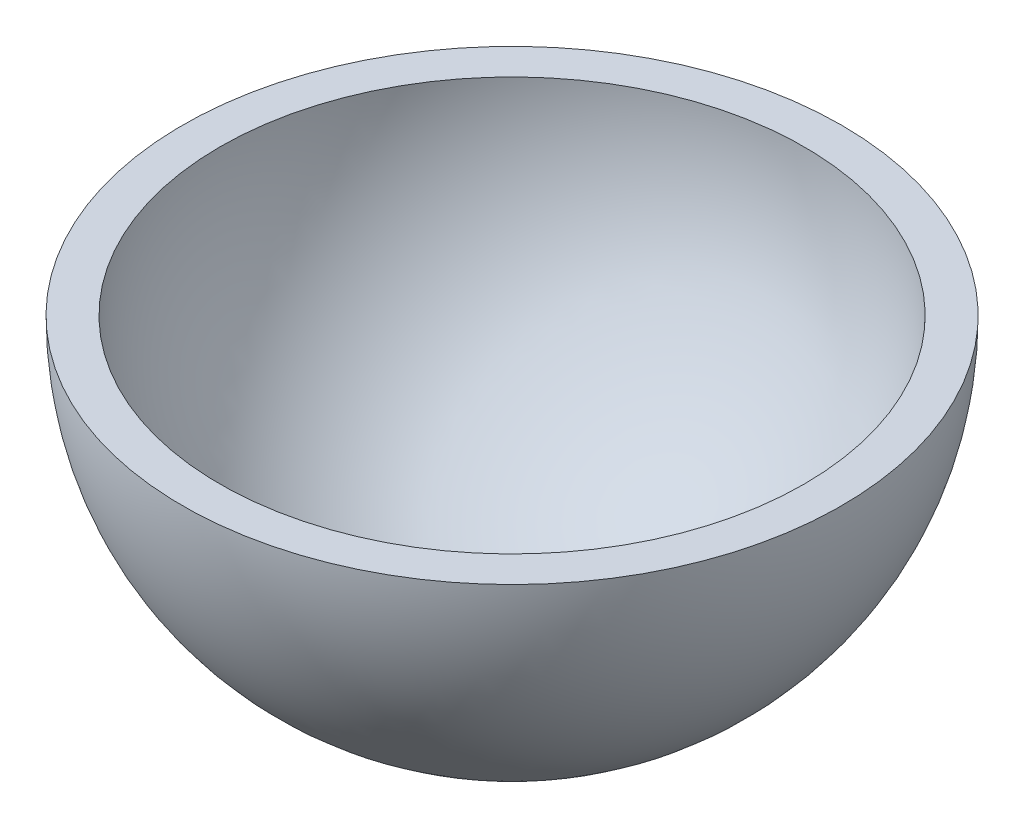
ISO-10303-21;
HEADER;
FILE_DESCRIPTION(('STEP AP214'),'2;1');
FILE_NAME('part.step','',(''),(''),'','','');
FILE_SCHEMA(('AUTOMOTIVE_DESIGN { 1 0 10303 214 1 1 1 1 }'));
ENDSEC;
DATA;
#1=APPLICATION_CONTEXT('core data for automotive mechanical design processes');
#2=APPLICATION_PROTOCOL_DEFINITION('international standard','automotive_design',2000,#1);
#3=PRODUCT_CONTEXT('',#1,'mechanical');
#4=PRODUCT('Part','Part','',(#3));
#5=PRODUCT_RELATED_PRODUCT_CATEGORY('part','',(#4));
#6=PRODUCT_DEFINITION_FORMATION('','',#4);
#7=PRODUCT_DEFINITION_CONTEXT('part definition',#1,'design');
#8=PRODUCT_DEFINITION('design','',#6,#7);
#9=PRODUCT_DEFINITION_SHAPE('','',#8);
#10=(LENGTH_UNIT() NAMED_UNIT(*) SI_UNIT(.MILLI.,.METRE.));
#11=(NAMED_UNIT(*) PLANE_ANGLE_UNIT() SI_UNIT($,.RADIAN.));
#12=(NAMED_UNIT(*) SI_UNIT($,.STERADIAN.) SOLID_ANGLE_UNIT());
#13=UNCERTAINTY_MEASURE_WITH_UNIT(LENGTH_MEASURE(1.E-05),#10,'distance_accuracy_value','');
#14=(GEOMETRIC_REPRESENTATION_CONTEXT(3) GLOBAL_UNCERTAINTY_ASSIGNED_CONTEXT((#13)) GLOBAL_UNIT_ASSIGNED_CONTEXT((#10,
#11,#12)) REPRESENTATION_CONTEXT('',''));
#15=CARTESIAN_POINT('',(0.,0.,0.));
#16=DIRECTION('',(0.,0.,1.));
#17=DIRECTION('',(1.,0.,0.));
#18=AXIS2_PLACEMENT_3D('',#15,#16,#17);
#19=CARTESIAN_POINT('',(0.,0.,-11.));
#20=DIRECTION('',(0.,0.,1.));
#21=DIRECTION('',(-1.,0.,0.));
#22=AXIS2_PLACEMENT_3D('',#19,#20,#21);
#23=SPHERICAL_SURFACE('',#22,11.);
#24=CARTESIAN_POINT('',(0.,0.,-11.));
#25=DIRECTION('',(0.,1.,0.));
#26=DIRECTION('',(0.,0.,-1.));
#27=AXIS2_PLACEMENT_3D('',#24,#25,#26);
#28=SPHERICAL_SURFACE('',#27,11.);
#29=CARTESIAN_POINT('',(0.,0.,-11.));
#30=DIRECTION('',(0.,1.,0.));
#31=DIRECTION('',(0.,0.,-1.));
#32=AXIS2_PLACEMENT_3D('',#29,#30,#31);
#33=CIRCLE('',#32,11.);
#34=CARTESIAN_POINT('',(0.,0.,-22.));
#35=VERTEX_POINT('',#34);
#36=EDGE_CURVE('E10',#35,#35,#33,.T.);
#37=ORIENTED_EDGE('',*,*,#36,.F.);
#38=EDGE_LOOP('',(#37));
#39=FACE_BOUND('',#38,.T.);
#40=ADVANCED_FACE('F38',(#39),#28,.T.);
#41=CARTESIAN_POINT('',(0.,0.,-11.));
#42=DIRECTION('',(0.,1.,0.));
#43=DIRECTION('',(0.,0.,-1.));
#44=AXIS2_PLACEMENT_3D('',#41,#42,#43);
#45=PLANE('',#44);
#46=CARTESIAN_POINT('',(0.,0.,-11.));
#47=DIRECTION('',(0.,1.,0.));
#48=DIRECTION('',(-1.,0.,0.));
#49=AXIS2_PLACEMENT_3D('',#46,#47,#48);
#50=CIRCLE('',#49,9.75);
#51=CARTESIAN_POINT('',(-9.75,0.,-11.));
#52=VERTEX_POINT('',#51);
#53=EDGE_CURVE('E44',#52,#52,#50,.T.);
#54=ORIENTED_EDGE('',*,*,#53,.F.);
#55=EDGE_LOOP('',(#54));
#56=FACE_BOUND('',#55,.T.);
#57=ORIENTED_EDGE('',*,*,#36,.T.);
#58=EDGE_LOOP('',(#57));
#59=FACE_BOUND('',#58,.T.);
#60=ADVANCED_FACE('F52',(#56,#59),#45,.T.);
#61=CARTESIAN_POINT('',(0.,0.,-11.));
#62=DIRECTION('',(0.,0.,1.));
#63=DIRECTION('',(-1.,0.,0.));
#64=AXIS2_PLACEMENT_3D('',#61,#62,#63);
#65=SPHERICAL_SURFACE('',#64,9.75);
#66=CARTESIAN_POINT('',(0.,0.,-11.));
#67=DIRECTION('',(0.,1.,0.));
#68=DIRECTION('',(-1.,0.,0.));
#69=AXIS2_PLACEMENT_3D('',#66,#67,#68);
#70=SPHERICAL_SURFACE('',#69,9.75);
#71=ORIENTED_EDGE('',*,*,#53,.T.);
#72=EDGE_LOOP('',(#71));
#73=FACE_BOUND('',#72,.T.);
#74=ADVANCED_FACE('F50',(#73),#70,.F.);
#75=CLOSED_SHELL('',(#40,#60,#74));
#76=MANIFOLD_SOLID_BREP('B2',#75);
#77=ADVANCED_BREP_SHAPE_REPRESENTATION('',(#18,#76),#14);
#78=SHAPE_DEFINITION_REPRESENTATION(#9,#77);
ENDSEC;
END-ISO-10303-21;
